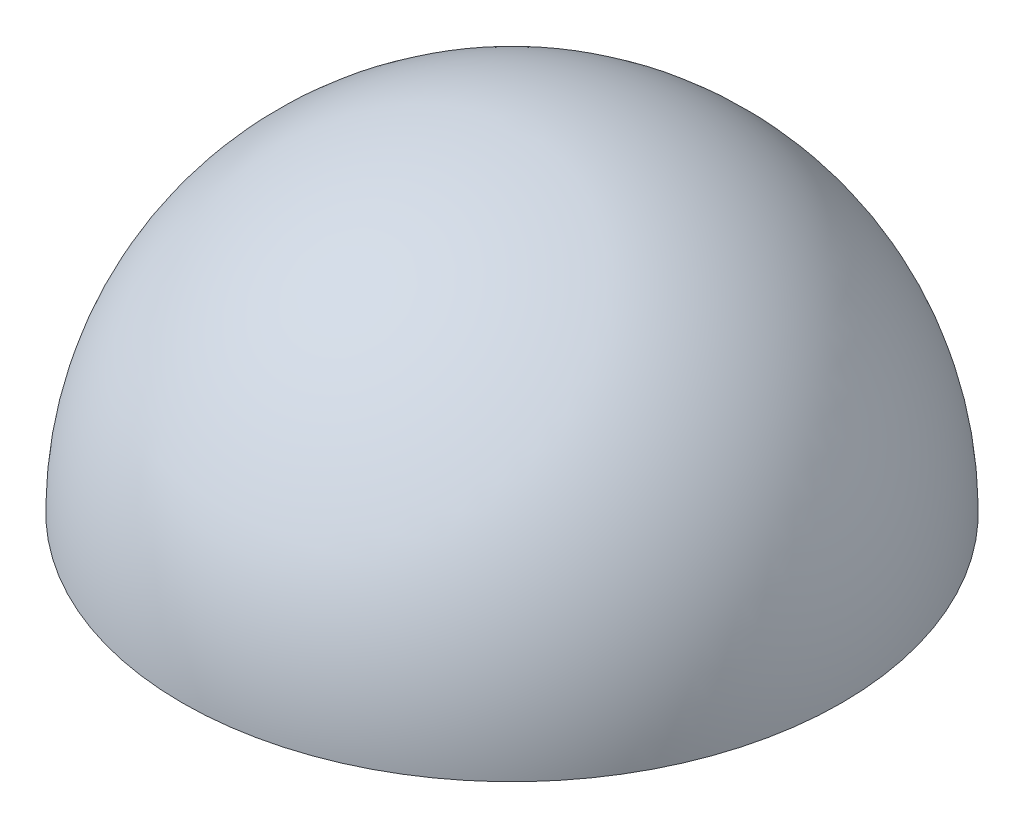
ISO-10303-21;
HEADER;
FILE_DESCRIPTION(('STEP AP214'),'2;1');
FILE_NAME('part.step','',(''),(''),'','','');
FILE_SCHEMA(('AUTOMOTIVE_DESIGN { 1 0 10303 214 1 1 1 1 }'));
ENDSEC;
DATA;
#1=APPLICATION_CONTEXT('core data for automotive mechanical design processes');
#2=APPLICATION_PROTOCOL_DEFINITION('international standard','automotive_design',2000,#1);
#3=PRODUCT_CONTEXT('',#1,'mechanical');
#4=PRODUCT('Part','Part','',(#3));
#5=PRODUCT_RELATED_PRODUCT_CATEGORY('part','',(#4));
#6=PRODUCT_DEFINITION_FORMATION('','',#4);
#7=PRODUCT_DEFINITION_CONTEXT('part definition',#1,'design');
#8=PRODUCT_DEFINITION('design','',#6,#7);
#9=PRODUCT_DEFINITION_SHAPE('','',#8);
#10=(LENGTH_UNIT() NAMED_UNIT(*) SI_UNIT(.MILLI.,.METRE.));
#11=(NAMED_UNIT(*) PLANE_ANGLE_UNIT() SI_UNIT($,.RADIAN.));
#12=(NAMED_UNIT(*) SI_UNIT($,.STERADIAN.) SOLID_ANGLE_UNIT());
#13=UNCERTAINTY_MEASURE_WITH_UNIT(LENGTH_MEASURE(1.E-05),#10,'distance_accuracy_value','');
#14=(GEOMETRIC_REPRESENTATION_CONTEXT(3) GLOBAL_UNCERTAINTY_ASSIGNED_CONTEXT((#13)) GLOBAL_UNIT_ASSIGNED_CONTEXT((#10,
#11,#12)) REPRESENTATION_CONTEXT('',''));
#15=CARTESIAN_POINT('',(0.,0.,0.));
#16=DIRECTION('',(0.,0.,1.));
#17=DIRECTION('',(1.,0.,0.));
#18=AXIS2_PLACEMENT_3D('',#15,#16,#17);
#19=CARTESIAN_POINT('',(0.,-206.142744186621,-263.352848866353));
#20=DIRECTION('',(0.,1.,0.));
#21=DIRECTION('',(0.,0.,1.));
#22=AXIS2_PLACEMENT_3D('',#19,#20,#21);
#23=PLANE('',#22);
#24=CARTESIAN_POINT('',(0.,-206.142744186621,-263.352848866353));
#25=DIRECTION('',(0.,1.,0.));
#26=DIRECTION('',(0.,0.,1.));
#27=AXIS2_PLACEMENT_3D('',#24,#25,#26);
#28=CIRCLE('',#27,26.2103943852149);
#29=CARTESIAN_POINT('',(0.,-206.142744186621,-237.142454481138));
#30=VERTEX_POINT('',#29);
#31=EDGE_CURVE('E10',#30,#30,#28,.T.);
#32=ORIENTED_EDGE('',*,*,#31,.F.);
#33=EDGE_LOOP('',(#32));
#34=FACE_BOUND('',#33,.T.);
#35=ADVANCED_FACE('F31',(#34),#23,.F.);
#36=CARTESIAN_POINT('',(0.,-206.142744186621,-263.352848866353));
#37=DIRECTION('',(0.,1.,0.));
#38=DIRECTION('',(0.,0.,-1.));
#39=AXIS2_PLACEMENT_3D('',#36,#37,#38);
#40=SPHERICAL_SURFACE('',#39,26.2103943852149);
#41=ORIENTED_EDGE('',*,*,#31,.T.);
#42=EDGE_LOOP('',(#41));
#43=FACE_BOUND('',#42,.T.);
#44=ADVANCED_FACE('F38',(#43),#40,.T.);
#45=CLOSED_SHELL('',(#35,#44));
#46=MANIFOLD_SOLID_BREP('B2',#45);
#47=ADVANCED_BREP_SHAPE_REPRESENTATION('',(#18,#46),#14);
#48=SHAPE_DEFINITION_REPRESENTATION(#9,#47);
ENDSEC;
END-ISO-10303-21;
